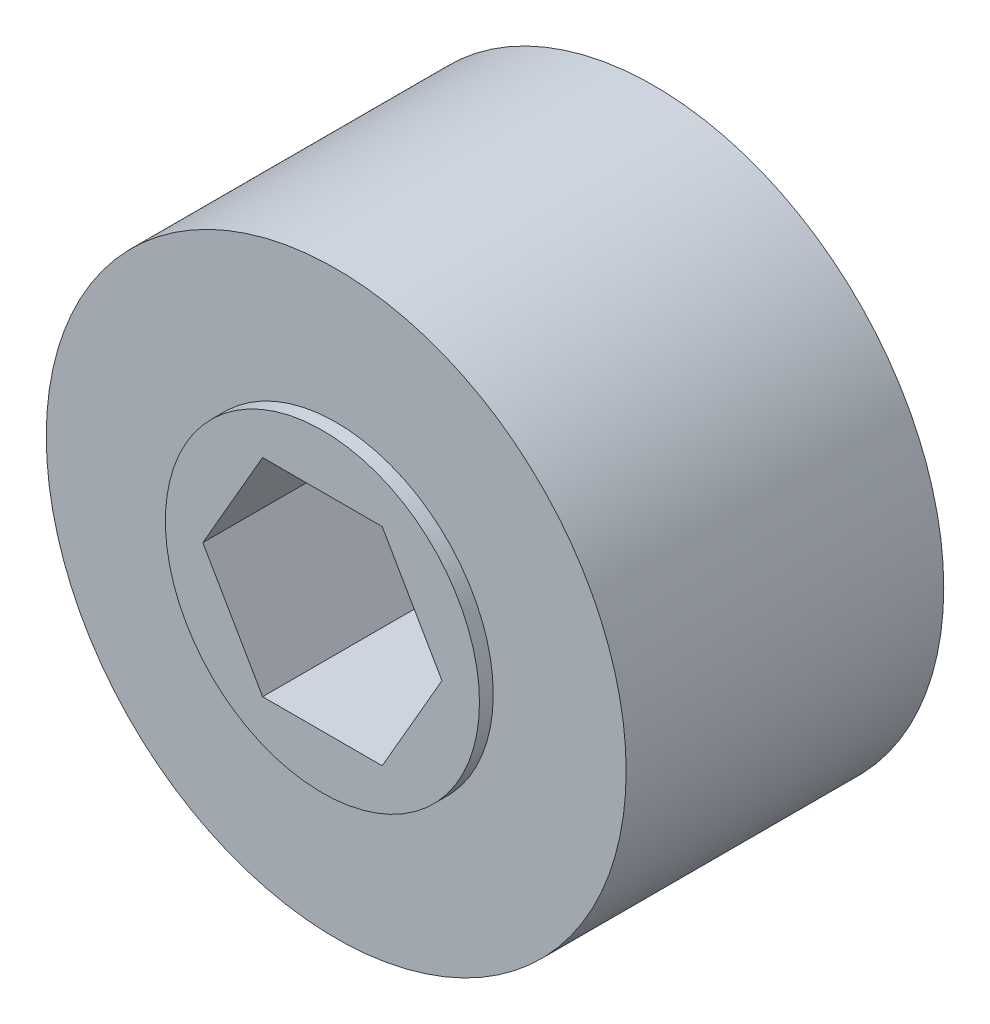
ISO-10303-21;
HEADER;
FILE_DESCRIPTION(('STEP AP214'),'2;1');
FILE_NAME('part.step','',(''),(''),'','','');
FILE_SCHEMA(('AUTOMOTIVE_DESIGN { 1 0 10303 214 1 1 1 1 }'));
ENDSEC;
DATA;
#1=APPLICATION_CONTEXT('core data for automotive mechanical design processes');
#2=APPLICATION_PROTOCOL_DEFINITION('international standard','automotive_design',2000,#1);
#3=PRODUCT_CONTEXT('',#1,'mechanical');
#4=PRODUCT('Part','Part','',(#3));
#5=PRODUCT_RELATED_PRODUCT_CATEGORY('part','',(#4));
#6=PRODUCT_DEFINITION_FORMATION('','',#4);
#7=PRODUCT_DEFINITION_CONTEXT('part definition',#1,'design');
#8=PRODUCT_DEFINITION('design','',#6,#7);
#9=PRODUCT_DEFINITION_SHAPE('','',#8);
#10=(LENGTH_UNIT() NAMED_UNIT(*) SI_UNIT(.MILLI.,.METRE.));
#11=(NAMED_UNIT(*) PLANE_ANGLE_UNIT() SI_UNIT($,.RADIAN.));
#12=(NAMED_UNIT(*) SI_UNIT($,.STERADIAN.) SOLID_ANGLE_UNIT());
#13=UNCERTAINTY_MEASURE_WITH_UNIT(LENGTH_MEASURE(1.E-05),#10,'distance_accuracy_value','');
#14=(GEOMETRIC_REPRESENTATION_CONTEXT(3) GLOBAL_UNCERTAINTY_ASSIGNED_CONTEXT((#13)) GLOBAL_UNIT_ASSIGNED_CONTEXT((#10,
#11,#12)) REPRESENTATION_CONTEXT('',''));
#15=CARTESIAN_POINT('',(0.,0.,0.));
#16=DIRECTION('',(0.,0.,1.));
#17=DIRECTION('',(1.,0.,0.));
#18=AXIS2_PLACEMENT_3D('',#15,#16,#17);
#19=CARTESIAN_POINT('',(0.,0.,15.24));
#20=DIRECTION('',(0.,0.,-1.));
#21=DIRECTION('',(-1.,0.,0.));
#22=AXIS2_PLACEMENT_3D('',#19,#20,#21);
#23=PLANE('',#22);
#24=DIRECTION('',(-0.5,0.866025403784439,0.));
#25=VECTOR('',#24,1.);
#26=CARTESIAN_POINT('',(5.49926131403119,0.,15.24));
#27=LINE('',#26,#25);
#28=CARTESIAN_POINT('',(2.7496306570156,4.7625,15.24));
#29=VERTEX_POINT('',#28);
#30=CARTESIAN_POINT('',(5.49926131403119,0.,15.24));
#31=VERTEX_POINT('',#30);
#32=EDGE_CURVE('E104',#29,#31,#27,.F.);
#33=ORIENTED_EDGE('',*,*,#32,.T.);
#34=DIRECTION('',(0.5,0.866025403784438,0.));
#35=VECTOR('',#34,1.);
#36=CARTESIAN_POINT('',(2.7496306570156,-4.7625,15.24));
#37=LINE('',#36,#35);
#38=CARTESIAN_POINT('',(2.7496306570156,-4.7625,15.24));
#39=VERTEX_POINT('',#38);
#40=EDGE_CURVE('E112',#31,#39,#37,.F.);
#41=ORIENTED_EDGE('',*,*,#40,.T.);
#42=DIRECTION('',(1.,0.,0.));
#43=VECTOR('',#42,1.);
#44=CARTESIAN_POINT('',(-2.7496306570156,-4.7625,15.24));
#45=LINE('',#44,#43);
#46=CARTESIAN_POINT('',(-2.7496306570156,-4.7625,15.24));
#47=VERTEX_POINT('',#46);
#48=EDGE_CURVE('E116',#39,#47,#45,.F.);
#49=ORIENTED_EDGE('',*,*,#48,.T.);
#50=DIRECTION('',(0.5,-0.866025403784439,0.));
#51=VECTOR('',#50,1.);
#52=CARTESIAN_POINT('',(-5.49926131403119,0.,15.24));
#53=LINE('',#52,#51);
#54=CARTESIAN_POINT('',(-5.49926131403119,0.,15.24));
#55=VERTEX_POINT('',#54);
#56=EDGE_CURVE('E68',#47,#55,#53,.F.);
#57=ORIENTED_EDGE('',*,*,#56,.T.);
#58=DIRECTION('',(-0.5,-0.866025403784439,0.));
#59=VECTOR('',#58,1.);
#60=CARTESIAN_POINT('',(-2.7496306570156,4.7625,15.24));
#61=LINE('',#60,#59);
#62=CARTESIAN_POINT('',(-2.7496306570156,4.7625,15.24));
#63=VERTEX_POINT('',#62);
#64=EDGE_CURVE('E70',#55,#63,#61,.F.);
#65=ORIENTED_EDGE('',*,*,#64,.T.);
#66=DIRECTION('',(1.,0.,0.));
#67=VECTOR('',#66,1.);
#68=CARTESIAN_POINT('',(2.7496306570156,4.7625,15.24));
#69=LINE('',#68,#67);
#70=EDGE_CURVE('E73',#63,#29,#69,.T.);
#71=ORIENTED_EDGE('',*,*,#70,.T.);
#72=EDGE_LOOP('',(#33,#41,#49,#57,#65,#71));
#73=FACE_BOUND('',#72,.T.);
#74=CARTESIAN_POINT('',(0.,0.,15.24));
#75=DIRECTION('',(0.,0.,1.));
#76=DIRECTION('',(1.,0.,0.));
#77=AXIS2_PLACEMENT_3D('',#74,#75,#76);
#78=CIRCLE('',#77,7.22229513677947);
#79=CARTESIAN_POINT('',(7.22229513677947,0.,15.24));
#80=VERTEX_POINT('',#79);
#81=EDGE_CURVE('E20',#80,#80,#78,.F.);
#82=ORIENTED_EDGE('',*,*,#81,.F.);
#83=EDGE_LOOP('',(#82));
#84=FACE_BOUND('',#83,.T.);
#85=ADVANCED_FACE('F17',(#73,#84),#23,.F.);
#86=CARTESIAN_POINT('',(0.,0.,14.605));
#87=DIRECTION('',(0.,0.,1.));
#88=DIRECTION('',(1.,0.,0.));
#89=AXIS2_PLACEMENT_3D('',#86,#87,#88);
#90=CYLINDRICAL_SURFACE('',#89,7.22229513677947);
#91=CARTESIAN_POINT('',(0.,0.,14.605));
#92=DIRECTION('',(0.,0.,1.));
#93=DIRECTION('',(1.,0.,0.));
#94=AXIS2_PLACEMENT_3D('',#91,#92,#93);
#95=CIRCLE('',#94,7.22229513677947);
#96=CARTESIAN_POINT('',(7.22229513677947,0.,14.605));
#97=VERTEX_POINT('',#96);
#98=EDGE_CURVE('E98',#97,#97,#95,.T.);
#99=ORIENTED_EDGE('',*,*,#98,.T.);
#100=EDGE_LOOP('',(#99));
#101=FACE_BOUND('',#100,.T.);
#102=ORIENTED_EDGE('',*,*,#81,.T.);
#103=EDGE_LOOP('',(#102));
#104=FACE_BOUND('',#103,.T.);
#105=ADVANCED_FACE('F224',(#101,#104),#90,.T.);
#106=CARTESIAN_POINT('',(2.7496306570156,4.7625,15.24));
#107=DIRECTION('',(0.,1.,0.));
#108=DIRECTION('',(0.,0.,1.));
#109=AXIS2_PLACEMENT_3D('',#106,#107,#108);
#110=PLANE('',#109);
#111=DIRECTION('',(0.,0.,1.));
#112=VECTOR('',#111,1.);
#113=CARTESIAN_POINT('',(2.7496306570156,4.7625,15.24));
#114=LINE('',#113,#112);
#115=CARTESIAN_POINT('',(2.7496306570156,4.7625,0.));
#116=VERTEX_POINT('',#115);
#117=EDGE_CURVE('E84',#116,#29,#114,.T.);
#118=ORIENTED_EDGE('',*,*,#117,.T.);
#119=ORIENTED_EDGE('',*,*,#70,.F.);
#120=DIRECTION('',(0.,0.,1.));
#121=VECTOR('',#120,1.);
#122=CARTESIAN_POINT('',(-2.7496306570156,4.7625,15.24));
#123=LINE('',#122,#121);
#124=CARTESIAN_POINT('',(-2.7496306570156,4.7625,0.));
#125=VERTEX_POINT('',#124);
#126=EDGE_CURVE('E78',#63,#125,#123,.F.);
#127=ORIENTED_EDGE('',*,*,#126,.T.);
#128=DIRECTION('',(-1.,0.,0.));
#129=VECTOR('',#128,1.);
#130=CARTESIAN_POINT('',(0.,4.7625,0.));
#131=LINE('',#130,#129);
#132=EDGE_CURVE('E100',#116,#125,#131,.T.);
#133=ORIENTED_EDGE('',*,*,#132,.F.);
#134=EDGE_LOOP('',(#118,#119,#127,#133));
#135=FACE_BOUND('',#134,.T.);
#136=ADVANCED_FACE('F81',(#135),#110,.F.);
#137=CARTESIAN_POINT('',(-2.7496306570156,4.7625,15.24));
#138=DIRECTION('',(-0.866025403784439,0.5,0.));
#139=DIRECTION('',(-0.5,-0.866025403784439,0.));
#140=AXIS2_PLACEMENT_3D('',#137,#138,#139);
#141=PLANE('',#140);
#142=ORIENTED_EDGE('',*,*,#126,.F.);
#143=ORIENTED_EDGE('',*,*,#64,.F.);
#144=DIRECTION('',(0.,0.,1.));
#145=VECTOR('',#144,1.);
#146=CARTESIAN_POINT('',(-5.49926131403119,0.,15.24));
#147=LINE('',#146,#145);
#148=CARTESIAN_POINT('',(-5.49926131403119,0.,0.));
#149=VERTEX_POINT('',#148);
#150=EDGE_CURVE('E92',#55,#149,#147,.F.);
#151=ORIENTED_EDGE('',*,*,#150,.T.);
#152=DIRECTION('',(-0.500000000000001,-0.866025403784438,0.));
#153=VECTOR('',#152,1.);
#154=CARTESIAN_POINT('',(-2.7496306570156,4.7625,0.));
#155=LINE('',#154,#153);
#156=EDGE_CURVE('E89',#125,#149,#155,.T.);
#157=ORIENTED_EDGE('',*,*,#156,.F.);
#158=EDGE_LOOP('',(#142,#143,#151,#157));
#159=FACE_BOUND('',#158,.T.);
#160=ADVANCED_FACE('F87',(#159),#141,.F.);
#161=CARTESIAN_POINT('',(-5.49926131403119,0.,15.24));
#162=DIRECTION('',(-0.866025403784439,-0.5,0.));
#163=DIRECTION('',(0.5,-0.866025403784439,0.));
#164=AXIS2_PLACEMENT_3D('',#161,#162,#163);
#165=PLANE('',#164);
#166=ORIENTED_EDGE('',*,*,#150,.F.);
#167=ORIENTED_EDGE('',*,*,#56,.F.);
#168=DIRECTION('',(0.,0.,-1.));
#169=VECTOR('',#168,1.);
#170=CARTESIAN_POINT('',(-2.7496306570156,-4.7625,15.24));
#171=LINE('',#170,#169);
#172=CARTESIAN_POINT('',(-2.7496306570156,-4.7625,0.));
#173=VERTEX_POINT('',#172);
#174=EDGE_CURVE('E114',#47,#173,#171,.T.);
#175=ORIENTED_EDGE('',*,*,#174,.T.);
#176=DIRECTION('',(0.5,-0.866025403784438,0.));
#177=VECTOR('',#176,1.);
#178=CARTESIAN_POINT('',(-5.49926131403119,0.,0.));
#179=LINE('',#178,#177);
#180=EDGE_CURVE('E120',#149,#173,#179,.T.);
#181=ORIENTED_EDGE('',*,*,#180,.F.);
#182=EDGE_LOOP('',(#166,#167,#175,#181));
#183=FACE_BOUND('',#182,.T.);
#184=ADVANCED_FACE('F121',(#183),#165,.F.);
#185=CARTESIAN_POINT('',(-2.7496306570156,-4.7625,15.24));
#186=DIRECTION('',(0.,-1.,0.));
#187=DIRECTION('',(0.,0.,-1.));
#188=AXIS2_PLACEMENT_3D('',#185,#186,#187);
#189=PLANE('',#188);
#190=ORIENTED_EDGE('',*,*,#174,.F.);
#191=ORIENTED_EDGE('',*,*,#48,.F.);
#192=DIRECTION('',(0.,0.,1.));
#193=VECTOR('',#192,1.);
#194=CARTESIAN_POINT('',(2.7496306570156,-4.7625,15.24));
#195=LINE('',#194,#193);
#196=CARTESIAN_POINT('',(2.7496306570156,-4.7625,0.));
#197=VERTEX_POINT('',#196);
#198=EDGE_CURVE('E110',#39,#197,#195,.F.);
#199=ORIENTED_EDGE('',*,*,#198,.T.);
#200=DIRECTION('',(-1.,0.,0.));
#201=VECTOR('',#200,1.);
#202=CARTESIAN_POINT('',(0.,-4.7625,0.));
#203=LINE('',#202,#201);
#204=EDGE_CURVE('E126',#173,#197,#203,.F.);
#205=ORIENTED_EDGE('',*,*,#204,.F.);
#206=EDGE_LOOP('',(#190,#191,#199,#205));
#207=FACE_BOUND('',#206,.T.);
#208=ADVANCED_FACE('F142',(#207),#189,.F.);
#209=CARTESIAN_POINT('',(2.7496306570156,-4.7625,15.24));
#210=DIRECTION('',(0.866025403784438,-0.5,0.));
#211=DIRECTION('',(0.5,0.866025403784438,0.));
#212=AXIS2_PLACEMENT_3D('',#209,#210,#211);
#213=PLANE('',#212);
#214=ORIENTED_EDGE('',*,*,#198,.F.);
#215=ORIENTED_EDGE('',*,*,#40,.F.);
#216=DIRECTION('',(0.,0.,1.));
#217=VECTOR('',#216,1.);
#218=CARTESIAN_POINT('',(5.49926131403119,0.,15.24));
#219=LINE('',#218,#217);
#220=CARTESIAN_POINT('',(5.49926131403119,0.,0.));
#221=VERTEX_POINT('',#220);
#222=EDGE_CURVE('E35',#31,#221,#219,.F.);
#223=ORIENTED_EDGE('',*,*,#222,.T.);
#224=DIRECTION('',(0.500000000000001,0.866025403784438,0.));
#225=VECTOR('',#224,1.);
#226=CARTESIAN_POINT('',(2.7496306570156,-4.7625,0.));
#227=LINE('',#226,#225);
#228=EDGE_CURVE('E134',#197,#221,#227,.T.);
#229=ORIENTED_EDGE('',*,*,#228,.F.);
#230=EDGE_LOOP('',(#214,#215,#223,#229));
#231=FACE_BOUND('',#230,.T.);
#232=ADVANCED_FACE('F140',(#231),#213,.F.);
#233=CARTESIAN_POINT('',(5.49926131403119,0.,15.24));
#234=DIRECTION('',(0.866025403784439,0.5,0.));
#235=DIRECTION('',(-0.5,0.866025403784439,0.));
#236=AXIS2_PLACEMENT_3D('',#233,#234,#235);
#237=PLANE('',#236);
#238=ORIENTED_EDGE('',*,*,#222,.F.);
#239=ORIENTED_EDGE('',*,*,#32,.F.);
#240=ORIENTED_EDGE('',*,*,#117,.F.);
#241=DIRECTION('',(-0.5,0.866025403784438,0.));
#242=VECTOR('',#241,1.);
#243=CARTESIAN_POINT('',(5.49926131403119,0.,0.));
#244=LINE('',#243,#242);
#245=EDGE_CURVE('E97',#221,#116,#244,.T.);
#246=ORIENTED_EDGE('',*,*,#245,.F.);
#247=EDGE_LOOP('',(#238,#239,#240,#246));
#248=FACE_BOUND('',#247,.T.);
#249=ADVANCED_FACE('F137',(#248),#237,.F.);
#250=CARTESIAN_POINT('',(0.,0.,14.605));
#251=DIRECTION('',(0.,0.,-1.));
#252=DIRECTION('',(-1.,0.,0.));
#253=AXIS2_PLACEMENT_3D('',#250,#251,#252);
#254=PLANE('',#253);
#255=ORIENTED_EDGE('',*,*,#98,.F.);
#256=EDGE_LOOP('',(#255));
#257=FACE_BOUND('',#256,.T.);
#258=CARTESIAN_POINT('',(0.,0.,14.605));
#259=DIRECTION('',(0.,0.,1.));
#260=DIRECTION('',(1.,0.,0.));
#261=AXIS2_PLACEMENT_3D('',#258,#259,#260);
#262=CIRCLE('',#261,13.335);
#263=CARTESIAN_POINT('',(13.335,0.,14.605));
#264=VERTEX_POINT('',#263);
#265=EDGE_CURVE('E26',#264,#264,#262,.F.);
#266=ORIENTED_EDGE('',*,*,#265,.F.);
#267=EDGE_LOOP('',(#266));
#268=FACE_BOUND('',#267,.T.);
#269=ADVANCED_FACE('F159',(#257,#268),#254,.F.);
#270=CARTESIAN_POINT('',(0.,0.,0.));
#271=DIRECTION('',(0.,0.,-1.));
#272=DIRECTION('',(-1.,0.,0.));
#273=AXIS2_PLACEMENT_3D('',#270,#271,#272);
#274=PLANE('',#273);
#275=ORIENTED_EDGE('',*,*,#228,.T.);
#276=ORIENTED_EDGE('',*,*,#245,.T.);
#277=ORIENTED_EDGE('',*,*,#132,.T.);
#278=ORIENTED_EDGE('',*,*,#156,.T.);
#279=ORIENTED_EDGE('',*,*,#180,.T.);
#280=ORIENTED_EDGE('',*,*,#204,.T.);
#281=EDGE_LOOP('',(#275,#276,#277,#278,#279,#280));
#282=FACE_BOUND('',#281,.T.);
#283=CARTESIAN_POINT('',(0.,0.,0.));
#284=DIRECTION('',(0.,0.,1.));
#285=DIRECTION('',(1.,0.,0.));
#286=AXIS2_PLACEMENT_3D('',#283,#284,#285);
#287=CIRCLE('',#286,13.335);
#288=CARTESIAN_POINT('',(13.335,0.,0.));
#289=VERTEX_POINT('',#288);
#290=EDGE_CURVE('E11',#289,#289,#287,.T.);
#291=ORIENTED_EDGE('',*,*,#290,.F.);
#292=EDGE_LOOP('',(#291));
#293=FACE_BOUND('',#292,.T.);
#294=ADVANCED_FACE('F129',(#282,#293),#274,.T.);
#295=CARTESIAN_POINT('',(0.,0.,0.));
#296=DIRECTION('',(0.,0.,1.));
#297=DIRECTION('',(1.,0.,0.));
#298=AXIS2_PLACEMENT_3D('',#295,#296,#297);
#299=CYLINDRICAL_SURFACE('',#298,13.335);
#300=ORIENTED_EDGE('',*,*,#290,.T.);
#301=EDGE_LOOP('',(#300));
#302=FACE_BOUND('',#301,.T.);
#303=ORIENTED_EDGE('',*,*,#265,.T.);
#304=EDGE_LOOP('',(#303));
#305=FACE_BOUND('',#304,.T.);
#306=ADVANCED_FACE('F152',(#302,#305),#299,.T.);
#307=CLOSED_SHELL('',(#85,#105,#136,#160,#184,#208,#232,#249,#269,#294,#306));
#308=MANIFOLD_SOLID_BREP('B1',#307);
#309=ADVANCED_BREP_SHAPE_REPRESENTATION('',(#18,#308),#14);
#310=SHAPE_DEFINITION_REPRESENTATION(#9,#309);
ENDSEC;
END-ISO-10303-21;
